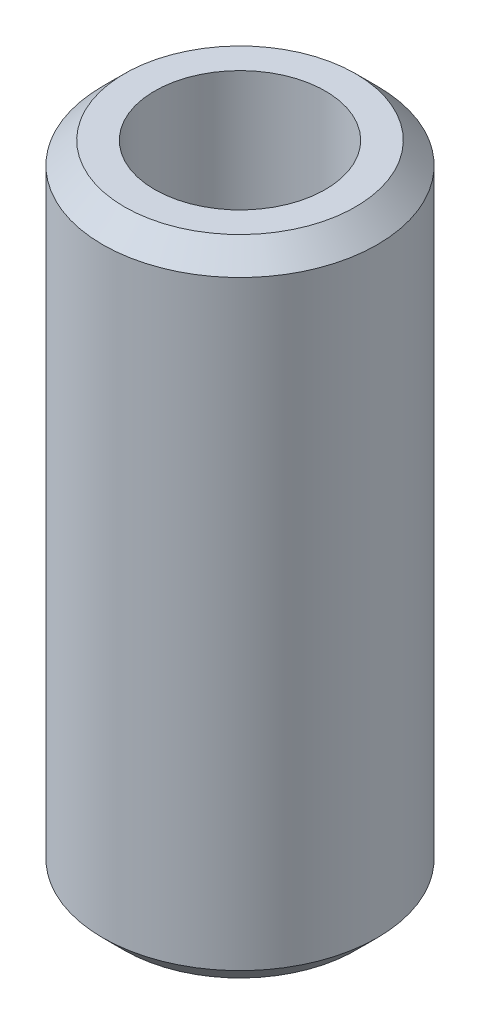
ISO-10303-21;
HEADER;
FILE_DESCRIPTION(('STEP AP214'),'2;1');
FILE_NAME('part.step','',(''),(''),'','','');
FILE_SCHEMA(('AUTOMOTIVE_DESIGN { 1 0 10303 214 1 1 1 1 }'));
ENDSEC;
DATA;
#1=APPLICATION_CONTEXT('core data for automotive mechanical design processes');
#2=APPLICATION_PROTOCOL_DEFINITION('international standard','automotive_design',2000,#1);
#3=PRODUCT_CONTEXT('',#1,'mechanical');
#4=PRODUCT('Part','Part','',(#3));
#5=PRODUCT_RELATED_PRODUCT_CATEGORY('part','',(#4));
#6=PRODUCT_DEFINITION_FORMATION('','',#4);
#7=PRODUCT_DEFINITION_CONTEXT('part definition',#1,'design');
#8=PRODUCT_DEFINITION('design','',#6,#7);
#9=PRODUCT_DEFINITION_SHAPE('','',#8);
#10=(LENGTH_UNIT() NAMED_UNIT(*) SI_UNIT(.MILLI.,.METRE.));
#11=(NAMED_UNIT(*) PLANE_ANGLE_UNIT() SI_UNIT($,.RADIAN.));
#12=(NAMED_UNIT(*) SI_UNIT($,.STERADIAN.) SOLID_ANGLE_UNIT());
#13=UNCERTAINTY_MEASURE_WITH_UNIT(LENGTH_MEASURE(1.E-05),#10,'distance_accuracy_value','');
#14=(GEOMETRIC_REPRESENTATION_CONTEXT(3) GLOBAL_UNCERTAINTY_ASSIGNED_CONTEXT((#13)) GLOBAL_UNIT_ASSIGNED_CONTEXT((#10,
#11,#12)) REPRESENTATION_CONTEXT('',''));
#15=CARTESIAN_POINT('',(0.,0.,0.));
#16=DIRECTION('',(0.,0.,1.));
#17=DIRECTION('',(1.,0.,0.));
#18=AXIS2_PLACEMENT_3D('',#15,#16,#17);
#19=CARTESIAN_POINT('',(0.,82.0723683769087,0.));
#20=DIRECTION('',(0.,-1.,0.));
#21=DIRECTION('',(0.,0.,-1.));
#22=AXIS2_PLACEMENT_3D('',#19,#20,#21);
#23=CYLINDRICAL_SURFACE('',#22,17.5);
#24=CARTESIAN_POINT('',(0.,79.2929250305217,0.));
#25=DIRECTION('',(0.,1.,0.));
#26=DIRECTION('',(0.,0.,1.));
#27=AXIS2_PLACEMENT_3D('',#24,#25,#26);
#28=CIRCLE('',#27,17.5);
#29=CARTESIAN_POINT('',(0.,79.2929250305217,17.5));
#30=VERTEX_POINT('',#29);
#31=EDGE_CURVE('E50',#30,#30,#28,.F.);
#32=ORIENTED_EDGE('',*,*,#31,.T.);
#33=EDGE_LOOP('',(#32));
#34=FACE_BOUND('',#33,.T.);
#35=CARTESIAN_POINT('',(0.,2.77944334638697,0.));
#36=DIRECTION('',(0.,1.,0.));
#37=DIRECTION('',(0.,0.,1.));
#38=AXIS2_PLACEMENT_3D('',#35,#36,#37);
#39=CIRCLE('',#38,17.5);
#40=CARTESIAN_POINT('',(0.,2.77944334638697,17.5));
#41=VERTEX_POINT('',#40);
#42=EDGE_CURVE('E51',#41,#41,#39,.T.);
#43=ORIENTED_EDGE('',*,*,#42,.T.);
#44=EDGE_LOOP('',(#43));
#45=FACE_BOUND('',#44,.T.);
#46=ADVANCED_FACE('F39',(#34,#45),#23,.T.);
#47=CARTESIAN_POINT('',(0.,82.0723683769087,0.));
#48=DIRECTION('',(0.,1.,0.));
#49=DIRECTION('',(0.,0.,1.));
#50=AXIS2_PLACEMENT_3D('',#47,#48,#49);
#51=PLANE('',#50);
#52=CARTESIAN_POINT('',(0.,82.0723683769087,0.));
#53=DIRECTION('',(0.,1.,0.));
#54=DIRECTION('',(0.,0.,1.));
#55=AXIS2_PLACEMENT_3D('',#52,#53,#54);
#56=CIRCLE('',#55,14.7205566536131);
#57=CARTESIAN_POINT('',(0.,82.0723683769087,14.7205566536131));
#58=VERTEX_POINT('',#57);
#59=EDGE_CURVE('E54',#58,#58,#56,.T.);
#60=ORIENTED_EDGE('',*,*,#59,.T.);
#61=EDGE_LOOP('',(#60));
#62=FACE_BOUND('',#61,.T.);
#63=CARTESIAN_POINT('',(0.,82.0723683769087,0.));
#64=DIRECTION('',(0.,1.,0.));
#65=DIRECTION('',(0.,0.,1.));
#66=AXIS2_PLACEMENT_3D('',#63,#64,#65);
#67=CIRCLE('',#66,10.8823265066807);
#68=CARTESIAN_POINT('',(0.,82.0723683769087,10.8823265066807));
#69=VERTEX_POINT('',#68);
#70=EDGE_CURVE('E58',#69,#69,#67,.T.);
#71=ORIENTED_EDGE('',*,*,#70,.F.);
#72=EDGE_LOOP('',(#71));
#73=FACE_BOUND('',#72,.T.);
#74=ADVANCED_FACE('F69',(#62,#73),#51,.T.);
#75=CARTESIAN_POINT('',(0.,0.,0.));
#76=DIRECTION('',(0.,1.,0.));
#77=DIRECTION('',(0.,0.,1.));
#78=AXIS2_PLACEMENT_3D('',#75,#76,#77);
#79=PLANE('',#78);
#80=CARTESIAN_POINT('',(0.,0.,0.));
#81=DIRECTION('',(0.,1.,0.));
#82=DIRECTION('',(0.,0.,1.));
#83=AXIS2_PLACEMENT_3D('',#80,#81,#82);
#84=CIRCLE('',#83,14.720556653613);
#85=CARTESIAN_POINT('',(0.,0.,14.720556653613));
#86=VERTEX_POINT('',#85);
#87=EDGE_CURVE('E10',#86,#86,#84,.F.);
#88=ORIENTED_EDGE('',*,*,#87,.T.);
#89=EDGE_LOOP('',(#88));
#90=FACE_BOUND('',#89,.T.);
#91=CARTESIAN_POINT('',(0.,0.,0.));
#92=DIRECTION('',(0.,1.,0.));
#93=DIRECTION('',(0.,0.,1.));
#94=AXIS2_PLACEMENT_3D('',#91,#92,#93);
#95=CIRCLE('',#94,10.8823265066807);
#96=CARTESIAN_POINT('',(0.,0.,10.8823265066807));
#97=VERTEX_POINT('',#96);
#98=EDGE_CURVE('E63',#97,#97,#95,.T.);
#99=ORIENTED_EDGE('',*,*,#98,.T.);
#100=EDGE_LOOP('',(#99));
#101=FACE_BOUND('',#100,.T.);
#102=ADVANCED_FACE('F75',(#90,#101),#79,.F.);
#103=CARTESIAN_POINT('',(0.,82.0723683769087,0.));
#104=DIRECTION('',(0.,-1.,0.));
#105=DIRECTION('',(0.,0.,-1.));
#106=AXIS2_PLACEMENT_3D('',#103,#104,#105);
#107=CYLINDRICAL_SURFACE('',#106,10.8823265066807);
#108=ORIENTED_EDGE('',*,*,#70,.T.);
#109=EDGE_LOOP('',(#108));
#110=FACE_BOUND('',#109,.T.);
#111=ORIENTED_EDGE('',*,*,#98,.F.);
#112=EDGE_LOOP('',(#111));
#113=FACE_BOUND('',#112,.T.);
#114=ADVANCED_FACE('F70',(#110,#113),#107,.F.);
#115=CARTESIAN_POINT('',(0.,82.0723683769087,0.));
#116=DIRECTION('',(0.,-1.,0.));
#117=DIRECTION('',(0.,0.,-1.));
#118=AXIS2_PLACEMENT_3D('',#115,#116,#117);
#119=CONICAL_SURFACE('',#118,14.7205566536131,0.785398163397444);
#120=ORIENTED_EDGE('',*,*,#31,.F.);
#121=EDGE_LOOP('',(#120));
#122=FACE_BOUND('',#121,.T.);
#123=ORIENTED_EDGE('',*,*,#59,.F.);
#124=EDGE_LOOP('',(#123));
#125=FACE_BOUND('',#124,.T.);
#126=ADVANCED_FACE('F81',(#122,#125),#119,.T.);
#127=CARTESIAN_POINT('',(0.,2.77944334638697,0.));
#128=DIRECTION('',(0.,1.,0.));
#129=DIRECTION('',(0.,0.,1.));
#130=AXIS2_PLACEMENT_3D('',#127,#128,#129);
#131=CONICAL_SURFACE('',#130,17.5,0.78539816339745);
#132=ORIENTED_EDGE('',*,*,#87,.F.);
#133=EDGE_LOOP('',(#132));
#134=FACE_BOUND('',#133,.T.);
#135=ORIENTED_EDGE('',*,*,#42,.F.);
#136=EDGE_LOOP('',(#135));
#137=FACE_BOUND('',#136,.T.);
#138=ADVANCED_FACE('F45',(#134,#137),#131,.T.);
#139=CLOSED_SHELL('',(#46,#74,#102,#114,#126,#138));
#140=MANIFOLD_SOLID_BREP('B2',#139);
#141=ADVANCED_BREP_SHAPE_REPRESENTATION('',(#18,#140),#14);
#142=SHAPE_DEFINITION_REPRESENTATION(#9,#141);
ENDSEC;
END-ISO-10303-21;
